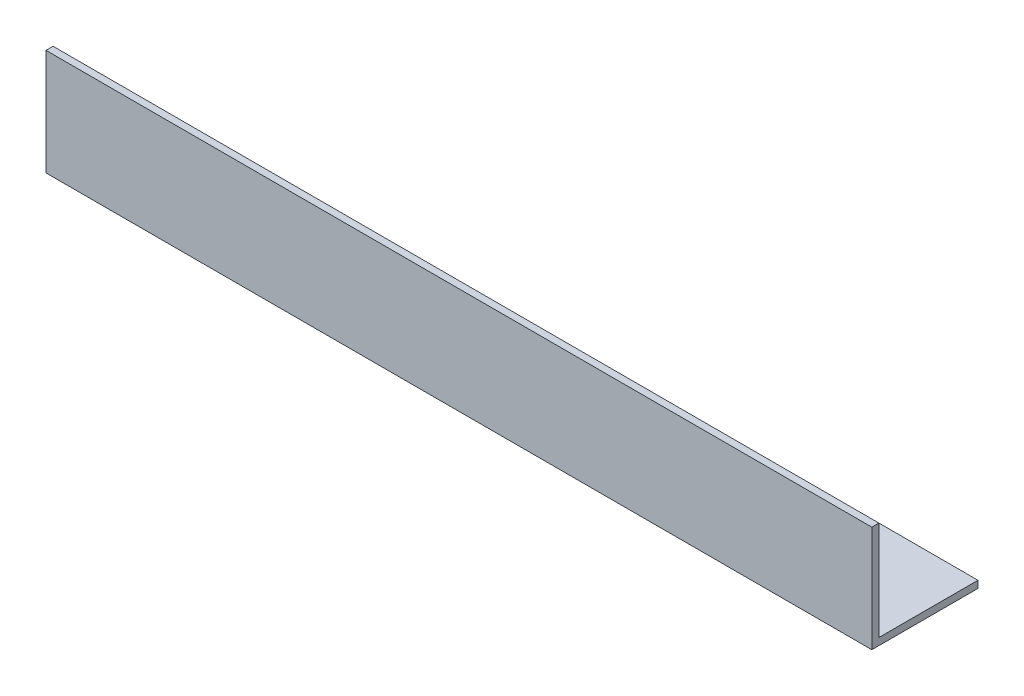
ISO-10303-21;
HEADER;
FILE_DESCRIPTION(('STEP AP214'),'2;1');
FILE_NAME('part.step','',(''),(''),'','','');
FILE_SCHEMA(('AUTOMOTIVE_DESIGN { 1 0 10303 214 1 1 1 1 }'));
ENDSEC;
DATA;
#1=APPLICATION_CONTEXT('core data for automotive mechanical design processes');
#2=APPLICATION_PROTOCOL_DEFINITION('international standard','automotive_design',2000,#1);
#3=PRODUCT_CONTEXT('',#1,'mechanical');
#4=PRODUCT('Part','Part','',(#3));
#5=PRODUCT_RELATED_PRODUCT_CATEGORY('part','',(#4));
#6=PRODUCT_DEFINITION_FORMATION('','',#4);
#7=PRODUCT_DEFINITION_CONTEXT('part definition',#1,'design');
#8=PRODUCT_DEFINITION('design','',#6,#7);
#9=PRODUCT_DEFINITION_SHAPE('','',#8);
#10=(LENGTH_UNIT() NAMED_UNIT(*) SI_UNIT(.MILLI.,.METRE.));
#11=(NAMED_UNIT(*) PLANE_ANGLE_UNIT() SI_UNIT($,.RADIAN.));
#12=(NAMED_UNIT(*) SI_UNIT($,.STERADIAN.) SOLID_ANGLE_UNIT());
#13=UNCERTAINTY_MEASURE_WITH_UNIT(LENGTH_MEASURE(1.E-05),#10,'distance_accuracy_value','');
#14=(GEOMETRIC_REPRESENTATION_CONTEXT(3) GLOBAL_UNCERTAINTY_ASSIGNED_CONTEXT((#13)) GLOBAL_UNIT_ASSIGNED_CONTEXT((#10,
#11,#12)) REPRESENTATION_CONTEXT('',''));
#15=CARTESIAN_POINT('',(0.,0.,0.));
#16=DIRECTION('',(0.,0.,1.));
#17=DIRECTION('',(1.,0.,0.));
#18=AXIS2_PLACEMENT_3D('',#15,#16,#17);
#19=CARTESIAN_POINT('',(350.,0.,0.));
#20=DIRECTION('',(0.,1.,0.));
#21=DIRECTION('',(0.,0.,1.));
#22=AXIS2_PLACEMENT_3D('',#19,#20,#21);
#23=PLANE('',#22);
#24=DIRECTION('',(0.,0.,-1.));
#25=VECTOR('',#24,1.);
#26=CARTESIAN_POINT('',(0.,0.,0.));
#27=LINE('',#26,#25);
#28=CARTESIAN_POINT('',(0.,0.,0.));
#29=VERTEX_POINT('',#28);
#30=CARTESIAN_POINT('',(0.,0.,-45.));
#31=VERTEX_POINT('',#30);
#32=EDGE_CURVE('E115',#29,#31,#27,.T.);
#33=ORIENTED_EDGE('',*,*,#32,.T.);
#34=DIRECTION('',(-1.,0.,0.));
#35=VECTOR('',#34,1.);
#36=CARTESIAN_POINT('',(350.,0.,-45.));
#37=LINE('',#36,#35);
#38=CARTESIAN_POINT('',(350.,0.,-45.));
#39=VERTEX_POINT('',#38);
#40=EDGE_CURVE('E11',#39,#31,#37,.T.);
#41=ORIENTED_EDGE('',*,*,#40,.F.);
#42=DIRECTION('',(0.,0.,-1.));
#43=VECTOR('',#42,1.);
#44=CARTESIAN_POINT('',(350.,0.,0.));
#45=LINE('',#44,#43);
#46=CARTESIAN_POINT('',(350.,0.,0.));
#47=VERTEX_POINT('',#46);
#48=EDGE_CURVE('E80',#47,#39,#45,.T.);
#49=ORIENTED_EDGE('',*,*,#48,.F.);
#50=DIRECTION('',(-1.,0.,0.));
#51=VECTOR('',#50,1.);
#52=CARTESIAN_POINT('',(350.,0.,0.));
#53=LINE('',#52,#51);
#54=EDGE_CURVE('E111',#47,#29,#53,.T.);
#55=ORIENTED_EDGE('',*,*,#54,.T.);
#56=EDGE_LOOP('',(#33,#41,#49,#55));
#57=FACE_BOUND('',#56,.T.);
#58=ADVANCED_FACE('F34',(#57),#23,.F.);
#59=CARTESIAN_POINT('',(350.,3.,-45.));
#60=DIRECTION('',(0.,0.,-1.));
#61=DIRECTION('',(-1.,0.,0.));
#62=AXIS2_PLACEMENT_3D('',#59,#60,#61);
#63=PLANE('',#62);
#64=DIRECTION('',(0.,-1.,0.));
#65=VECTOR('',#64,1.);
#66=CARTESIAN_POINT('',(0.,3.,-45.));
#67=LINE('',#66,#65);
#68=CARTESIAN_POINT('',(0.,3.,-45.));
#69=VERTEX_POINT('',#68);
#70=EDGE_CURVE('E118',#69,#31,#67,.T.);
#71=ORIENTED_EDGE('',*,*,#70,.F.);
#72=DIRECTION('',(-1.,0.,0.));
#73=VECTOR('',#72,1.);
#74=CARTESIAN_POINT('',(350.,3.,-45.));
#75=LINE('',#74,#73);
#76=CARTESIAN_POINT('',(350.,3.,-45.));
#77=VERTEX_POINT('',#76);
#78=EDGE_CURVE('E42',#77,#69,#75,.T.);
#79=ORIENTED_EDGE('',*,*,#78,.F.);
#80=DIRECTION('',(0.,-1.,0.));
#81=VECTOR('',#80,1.);
#82=CARTESIAN_POINT('',(350.,3.,-45.));
#83=LINE('',#82,#81);
#84=EDGE_CURVE('E204',#77,#39,#83,.T.);
#85=ORIENTED_EDGE('',*,*,#84,.T.);
#86=ORIENTED_EDGE('',*,*,#40,.T.);
#87=EDGE_LOOP('',(#71,#79,#85,#86));
#88=FACE_BOUND('',#87,.T.);
#89=ADVANCED_FACE('F136',(#88),#63,.T.);
#90=CARTESIAN_POINT('',(350.,3.,0.));
#91=DIRECTION('',(0.,1.,0.));
#92=DIRECTION('',(0.,0.,1.));
#93=AXIS2_PLACEMENT_3D('',#90,#91,#92);
#94=PLANE('',#93);
#95=DIRECTION('',(0.,0.,-1.));
#96=VECTOR('',#95,1.);
#97=CARTESIAN_POINT('',(0.,3.,0.));
#98=LINE('',#97,#96);
#99=CARTESIAN_POINT('',(0.,3.,-3.));
#100=VERTEX_POINT('',#99);
#101=EDGE_CURVE('E121',#100,#69,#98,.T.);
#102=ORIENTED_EDGE('',*,*,#101,.F.);
#103=DIRECTION('',(-1.,0.,0.));
#104=VECTOR('',#103,1.);
#105=CARTESIAN_POINT('',(350.,3.,-3.));
#106=LINE('',#105,#104);
#107=CARTESIAN_POINT('',(350.,3.,-3.));
#108=VERTEX_POINT('',#107);
#109=EDGE_CURVE('E101',#108,#100,#106,.T.);
#110=ORIENTED_EDGE('',*,*,#109,.F.);
#111=DIRECTION('',(0.,0.,-1.));
#112=VECTOR('',#111,1.);
#113=CARTESIAN_POINT('',(350.,3.,0.));
#114=LINE('',#113,#112);
#115=EDGE_CURVE('E107',#108,#77,#114,.T.);
#116=ORIENTED_EDGE('',*,*,#115,.T.);
#117=ORIENTED_EDGE('',*,*,#78,.T.);
#118=EDGE_LOOP('',(#102,#110,#116,#117));
#119=FACE_BOUND('',#118,.T.);
#120=ADVANCED_FACE('F133',(#119),#94,.T.);
#121=CARTESIAN_POINT('',(350.,0.,-3.));
#122=DIRECTION('',(0.,0.,-1.));
#123=DIRECTION('',(-1.,0.,0.));
#124=AXIS2_PLACEMENT_3D('',#121,#122,#123);
#125=PLANE('',#124);
#126=DIRECTION('',(0.,1.,0.));
#127=VECTOR('',#126,1.);
#128=CARTESIAN_POINT('',(0.,0.,-3.));
#129=LINE('',#128,#127);
#130=CARTESIAN_POINT('',(0.,45.,-3.));
#131=VERTEX_POINT('',#130);
#132=EDGE_CURVE('E96',#131,#100,#129,.F.);
#133=ORIENTED_EDGE('',*,*,#132,.F.);
#134=DIRECTION('',(-1.,0.,0.));
#135=VECTOR('',#134,1.);
#136=CARTESIAN_POINT('',(350.,45.,-3.));
#137=LINE('',#136,#135);
#138=CARTESIAN_POINT('',(350.,45.,-3.));
#139=VERTEX_POINT('',#138);
#140=EDGE_CURVE('E91',#139,#131,#137,.T.);
#141=ORIENTED_EDGE('',*,*,#140,.F.);
#142=DIRECTION('',(0.,1.,0.));
#143=VECTOR('',#142,1.);
#144=CARTESIAN_POINT('',(350.,0.,-3.));
#145=LINE('',#144,#143);
#146=EDGE_CURVE('E94',#139,#108,#145,.F.);
#147=ORIENTED_EDGE('',*,*,#146,.T.);
#148=ORIENTED_EDGE('',*,*,#109,.T.);
#149=EDGE_LOOP('',(#133,#141,#147,#148));
#150=FACE_BOUND('',#149,.T.);
#151=ADVANCED_FACE('F93',(#150),#125,.T.);
#152=CARTESIAN_POINT('',(350.,45.,0.));
#153=DIRECTION('',(0.,1.,0.));
#154=DIRECTION('',(0.,0.,1.));
#155=AXIS2_PLACEMENT_3D('',#152,#153,#154);
#156=PLANE('',#155);
#157=DIRECTION('',(0.,0.,-1.));
#158=VECTOR('',#157,1.);
#159=CARTESIAN_POINT('',(0.,45.,0.));
#160=LINE('',#159,#158);
#161=CARTESIAN_POINT('',(0.,45.,0.));
#162=VERTEX_POINT('',#161);
#163=EDGE_CURVE('E125',#162,#131,#160,.T.);
#164=ORIENTED_EDGE('',*,*,#163,.F.);
#165=DIRECTION('',(-1.,0.,0.));
#166=VECTOR('',#165,1.);
#167=CARTESIAN_POINT('',(350.,45.,0.));
#168=LINE('',#167,#166);
#169=CARTESIAN_POINT('',(350.,45.,0.));
#170=VERTEX_POINT('',#169);
#171=EDGE_CURVE('E71',#170,#162,#168,.T.);
#172=ORIENTED_EDGE('',*,*,#171,.F.);
#173=DIRECTION('',(0.,0.,-1.));
#174=VECTOR('',#173,1.);
#175=CARTESIAN_POINT('',(350.,45.,0.));
#176=LINE('',#175,#174);
#177=EDGE_CURVE('E105',#170,#139,#176,.T.);
#178=ORIENTED_EDGE('',*,*,#177,.T.);
#179=ORIENTED_EDGE('',*,*,#140,.T.);
#180=EDGE_LOOP('',(#164,#172,#178,#179));
#181=FACE_BOUND('',#180,.T.);
#182=ADVANCED_FACE('F109',(#181),#156,.T.);
#183=CARTESIAN_POINT('',(350.,0.,0.));
#184=DIRECTION('',(0.,0.,-1.));
#185=DIRECTION('',(-1.,0.,0.));
#186=AXIS2_PLACEMENT_3D('',#183,#184,#185);
#187=PLANE('',#186);
#188=DIRECTION('',(0.,-1.,0.));
#189=VECTOR('',#188,1.);
#190=CARTESIAN_POINT('',(0.,0.,0.));
#191=LINE('',#190,#189);
#192=EDGE_CURVE('E74',#162,#29,#191,.T.);
#193=ORIENTED_EDGE('',*,*,#192,.T.);
#194=ORIENTED_EDGE('',*,*,#54,.F.);
#195=DIRECTION('',(0.,-1.,0.));
#196=VECTOR('',#195,1.);
#197=CARTESIAN_POINT('',(350.,0.,0.));
#198=LINE('',#197,#196);
#199=EDGE_CURVE('E50',#170,#47,#198,.T.);
#200=ORIENTED_EDGE('',*,*,#199,.F.);
#201=ORIENTED_EDGE('',*,*,#171,.T.);
#202=EDGE_LOOP('',(#193,#194,#200,#201));
#203=FACE_BOUND('',#202,.T.);
#204=ADVANCED_FACE('F141',(#203),#187,.F.);
#205=CARTESIAN_POINT('',(350.,0.,0.));
#206=DIRECTION('',(-1.,0.,0.));
#207=DIRECTION('',(0.,0.,1.));
#208=AXIS2_PLACEMENT_3D('',#205,#206,#207);
#209=PLANE('',#208);
#210=ORIENTED_EDGE('',*,*,#48,.T.);
#211=ORIENTED_EDGE('',*,*,#84,.F.);
#212=ORIENTED_EDGE('',*,*,#115,.F.);
#213=ORIENTED_EDGE('',*,*,#146,.F.);
#214=ORIENTED_EDGE('',*,*,#177,.F.);
#215=ORIENTED_EDGE('',*,*,#199,.T.);
#216=EDGE_LOOP('',(#210,#211,#212,#213,#214,#215));
#217=FACE_BOUND('',#216,.T.);
#218=ADVANCED_FACE('F104',(#217),#209,.F.);
#219=CARTESIAN_POINT('',(0.,0.,0.));
#220=DIRECTION('',(-1.,0.,0.));
#221=DIRECTION('',(0.,0.,1.));
#222=AXIS2_PLACEMENT_3D('',#219,#220,#221);
#223=PLANE('',#222);
#224=ORIENTED_EDGE('',*,*,#32,.F.);
#225=ORIENTED_EDGE('',*,*,#192,.F.);
#226=ORIENTED_EDGE('',*,*,#163,.T.);
#227=ORIENTED_EDGE('',*,*,#132,.T.);
#228=ORIENTED_EDGE('',*,*,#101,.T.);
#229=ORIENTED_EDGE('',*,*,#70,.T.);
#230=EDGE_LOOP('',(#224,#225,#226,#227,#228,#229));
#231=FACE_BOUND('',#230,.T.);
#232=ADVANCED_FACE('F139',(#231),#223,.T.);
#233=CLOSED_SHELL('',(#58,#89,#120,#151,#182,#204,#218,#232));
#234=MANIFOLD_SOLID_BREP('B2',#233);
#235=ADVANCED_BREP_SHAPE_REPRESENTATION('',(#18,#234),#14);
#236=SHAPE_DEFINITION_REPRESENTATION(#9,#235);
ENDSEC;
END-ISO-10303-21;
